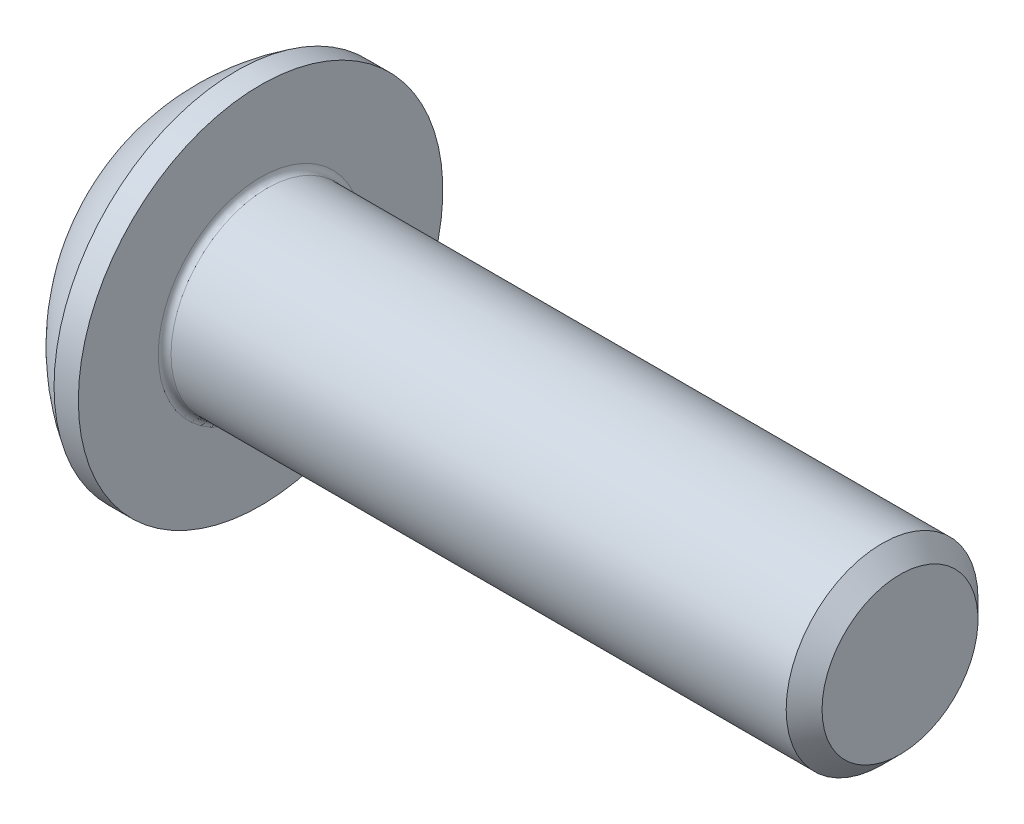
ISO-10303-21;
HEADER;
FILE_DESCRIPTION(('STEP AP214'),'2;1');
FILE_NAME('part.step','',(''),(''),'','','');
FILE_SCHEMA(('AUTOMOTIVE_DESIGN { 1 0 10303 214 1 1 1 1 }'));
ENDSEC;
DATA;
#1=APPLICATION_CONTEXT('core data for automotive mechanical design processes');
#2=APPLICATION_PROTOCOL_DEFINITION('international standard','automotive_design',2000,#1);
#3=PRODUCT_CONTEXT('',#1,'mechanical');
#4=PRODUCT('Part','Part','',(#3));
#5=PRODUCT_RELATED_PRODUCT_CATEGORY('part','',(#4));
#6=PRODUCT_DEFINITION_FORMATION('','',#4);
#7=PRODUCT_DEFINITION_CONTEXT('part definition',#1,'design');
#8=PRODUCT_DEFINITION('design','',#6,#7);
#9=PRODUCT_DEFINITION_SHAPE('','',#8);
#10=(LENGTH_UNIT() NAMED_UNIT(*) SI_UNIT(.MILLI.,.METRE.));
#11=(NAMED_UNIT(*) PLANE_ANGLE_UNIT() SI_UNIT($,.RADIAN.));
#12=(NAMED_UNIT(*) SI_UNIT($,.STERADIAN.) SOLID_ANGLE_UNIT());
#13=UNCERTAINTY_MEASURE_WITH_UNIT(LENGTH_MEASURE(1.E-05),#10,'distance_accuracy_value','');
#14=(GEOMETRIC_REPRESENTATION_CONTEXT(3) GLOBAL_UNCERTAINTY_ASSIGNED_CONTEXT((#13)) GLOBAL_UNIT_ASSIGNED_CONTEXT((#10,
#11,#12)) REPRESENTATION_CONTEXT('',''));
#15=CARTESIAN_POINT('',(0.,0.,0.));
#16=DIRECTION('',(0.,0.,1.));
#17=DIRECTION('',(1.,0.,0.));
#18=AXIS2_PLACEMENT_3D('',#15,#16,#17);
#19=CARTESIAN_POINT('',(0.,0.,0.));
#20=DIRECTION('',(-1.,0.,0.));
#21=DIRECTION('',(0.,0.,1.));
#22=AXIS2_PLACEMENT_3D('',#19,#20,#21);
#23=PLANE('',#22);
#24=CARTESIAN_POINT('',(0.,0.,0.));
#25=DIRECTION('',(-1.,0.,0.));
#26=DIRECTION('',(0.,0.,1.));
#27=AXIS2_PLACEMENT_3D('',#24,#25,#26);
#28=CIRCLE('',#27,1.425);
#29=CARTESIAN_POINT('',(0.,0.,1.425));
#30=VERTEX_POINT('',#29);
#31=EDGE_CURVE('E159',#30,#30,#28,.T.);
#32=ORIENTED_EDGE('',*,*,#31,.T.);
#33=EDGE_LOOP('',(#32));
#34=FACE_BOUND('',#33,.T.);
#35=DIRECTION('',(0.,-1.,0.));
#36=VECTOR('',#35,1.);
#37=CARTESIAN_POINT('',(0.,-0.577350269189625,1.));
#38=LINE('',#37,#36);
#39=CARTESIAN_POINT('',(0.,0.577350269189626,1.));
#40=VERTEX_POINT('',#39);
#41=CARTESIAN_POINT('',(0.,-0.577350269189625,1.));
#42=VERTEX_POINT('',#41);
#43=EDGE_CURVE('E49',#40,#42,#38,.T.);
#44=ORIENTED_EDGE('',*,*,#43,.T.);
#45=DIRECTION('',(0.,-0.5,-0.866025403784439));
#46=VECTOR('',#45,1.);
#47=CARTESIAN_POINT('',(0.,-1.15470053837925,0.));
#48=LINE('',#47,#46);
#49=CARTESIAN_POINT('',(0.,-1.15470053837925,0.));
#50=VERTEX_POINT('',#49);
#51=EDGE_CURVE('E252',#42,#50,#48,.T.);
#52=ORIENTED_EDGE('',*,*,#51,.T.);
#53=DIRECTION('',(0.,0.5,-0.866025403784439));
#54=VECTOR('',#53,1.);
#55=CARTESIAN_POINT('',(0.,-0.577350269189625,-1.));
#56=LINE('',#55,#54);
#57=CARTESIAN_POINT('',(0.,-0.577350269189625,-1.));
#58=VERTEX_POINT('',#57);
#59=EDGE_CURVE('E134',#50,#58,#56,.T.);
#60=ORIENTED_EDGE('',*,*,#59,.T.);
#61=DIRECTION('',(0.,1.,0.));
#62=VECTOR('',#61,1.);
#63=CARTESIAN_POINT('',(0.,0.577350269189626,-1.));
#64=LINE('',#63,#62);
#65=CARTESIAN_POINT('',(0.,0.577350269189626,-1.));
#66=VERTEX_POINT('',#65);
#67=EDGE_CURVE('E255',#58,#66,#64,.T.);
#68=ORIENTED_EDGE('',*,*,#67,.T.);
#69=DIRECTION('',(0.,0.5,0.866025403784438));
#70=VECTOR('',#69,1.);
#71=CARTESIAN_POINT('',(0.,1.15470053837925,0.));
#72=LINE('',#71,#70);
#73=CARTESIAN_POINT('',(0.,1.15470053837925,0.));
#74=VERTEX_POINT('',#73);
#75=EDGE_CURVE('E257',#66,#74,#72,.T.);
#76=ORIENTED_EDGE('',*,*,#75,.T.);
#77=DIRECTION('',(0.,-0.5,0.866025403784438));
#78=VECTOR('',#77,1.);
#79=CARTESIAN_POINT('',(0.,0.577350269189626,1.));
#80=LINE('',#79,#78);
#81=EDGE_CURVE('E259',#74,#40,#80,.T.);
#82=ORIENTED_EDGE('',*,*,#81,.T.);
#83=EDGE_LOOP('',(#44,#52,#60,#68,#76,#82));
#84=FACE_BOUND('',#83,.T.);
#85=ADVANCED_FACE('F34',(#34,#84),#23,.T.);
#86=CARTESIAN_POINT('',(3.03337598425197,0.,0.));
#87=DIRECTION('',(-1.,0.,0.));
#88=DIRECTION('',(0.,1.,0.));
#89=AXIS2_PLACEMENT_3D('',#86,#87,#88);
#90=SPHERICAL_SURFACE('',#89,3.35141684393878);
#91=CARTESIAN_POINT('',(1.27,0.,0.));
#92=DIRECTION('',(-1.,0.,0.));
#93=DIRECTION('',(0.,0.,1.));
#94=AXIS2_PLACEMENT_3D('',#91,#92,#93);
#95=CIRCLE('',#94,2.85);
#96=CARTESIAN_POINT('',(1.27,0.,2.85));
#97=VERTEX_POINT('',#96);
#98=EDGE_CURVE('E156',#97,#97,#95,.T.);
#99=ORIENTED_EDGE('',*,*,#98,.T.);
#100=EDGE_LOOP('',(#99));
#101=FACE_BOUND('',#100,.T.);
#102=ORIENTED_EDGE('',*,*,#31,.F.);
#103=EDGE_LOOP('',(#102));
#104=FACE_BOUND('',#103,.T.);
#105=ADVANCED_FACE('F180',(#101,#104),#90,.T.);
#106=CARTESIAN_POINT('',(0.,0.,0.));
#107=DIRECTION('',(-1.,0.,0.));
#108=DIRECTION('',(0.,0.,1.));
#109=AXIS2_PLACEMENT_3D('',#106,#107,#108);
#110=CYLINDRICAL_SURFACE('',#109,2.85);
#111=ORIENTED_EDGE('',*,*,#98,.F.);
#112=EDGE_LOOP('',(#111));
#113=FACE_BOUND('',#112,.T.);
#114=CARTESIAN_POINT('',(1.65,0.,0.));
#115=DIRECTION('',(-1.,0.,0.));
#116=DIRECTION('',(0.,0.,1.));
#117=AXIS2_PLACEMENT_3D('',#114,#115,#116);
#118=CIRCLE('',#117,2.85);
#119=CARTESIAN_POINT('',(1.65,0.,2.85));
#120=VERTEX_POINT('',#119);
#121=EDGE_CURVE('E153',#120,#120,#118,.T.);
#122=ORIENTED_EDGE('',*,*,#121,.T.);
#123=EDGE_LOOP('',(#122));
#124=FACE_BOUND('',#123,.T.);
#125=ADVANCED_FACE('F185',(#113,#124),#110,.T.);
#126=CARTESIAN_POINT('',(1.65,1.5,0.));
#127=DIRECTION('',(-1.,0.,0.));
#128=DIRECTION('',(0.,0.,1.));
#129=AXIS2_PLACEMENT_3D('',#126,#127,#128);
#130=PLANE('',#129);
#131=CARTESIAN_POINT('',(1.65,0.,0.));
#132=DIRECTION('',(-1.,0.,0.));
#133=DIRECTION('',(0.,0.,1.));
#134=AXIS2_PLACEMENT_3D('',#131,#132,#133);
#135=CIRCLE('',#134,1.6);
#136=CARTESIAN_POINT('',(1.65,0.,1.6));
#137=VERTEX_POINT('',#136);
#138=EDGE_CURVE('E42',#137,#137,#135,.T.);
#139=ORIENTED_EDGE('',*,*,#138,.T.);
#140=EDGE_LOOP('',(#139));
#141=FACE_BOUND('',#140,.T.);
#142=ORIENTED_EDGE('',*,*,#121,.F.);
#143=EDGE_LOOP('',(#142));
#144=FACE_BOUND('',#143,.T.);
#145=ADVANCED_FACE('F164',(#141,#144),#130,.F.);
#146=CARTESIAN_POINT('',(0.,0.,0.));
#147=DIRECTION('',(-1.,0.,0.));
#148=DIRECTION('',(0.,0.,1.));
#149=AXIS2_PLACEMENT_3D('',#146,#147,#148);
#150=CYLINDRICAL_SURFACE('',#149,1.5);
#151=CARTESIAN_POINT('',(1.75,0.,0.));
#152=DIRECTION('',(-1.,0.,0.));
#153=DIRECTION('',(0.,0.,1.));
#154=AXIS2_PLACEMENT_3D('',#151,#152,#153);
#155=CIRCLE('',#154,1.5);
#156=CARTESIAN_POINT('',(1.75,0.,1.5));
#157=VERTEX_POINT('',#156);
#158=EDGE_CURVE('E11',#157,#157,#155,.F.);
#159=ORIENTED_EDGE('',*,*,#158,.T.);
#160=EDGE_LOOP('',(#159));
#161=FACE_BOUND('',#160,.T.);
#162=CARTESIAN_POINT('',(11.3695,0.,0.));
#163=DIRECTION('',(-1.,0.,0.));
#164=DIRECTION('',(0.,0.,1.));
#165=AXIS2_PLACEMENT_3D('',#162,#163,#164);
#166=CIRCLE('',#165,1.5);
#167=CARTESIAN_POINT('',(11.3695,0.,1.5));
#168=VERTEX_POINT('',#167);
#169=EDGE_CURVE('E150',#168,#168,#166,.T.);
#170=ORIENTED_EDGE('',*,*,#169,.T.);
#171=EDGE_LOOP('',(#170));
#172=FACE_BOUND('',#171,.T.);
#173=ADVANCED_FACE('F194',(#161,#172),#150,.T.);
#174=CARTESIAN_POINT('',(11.65,0.,0.));
#175=DIRECTION('',(-1.,0.,0.));
#176=DIRECTION('',(0.,0.,1.));
#177=AXIS2_PLACEMENT_3D('',#174,#175,#176);
#178=CONICAL_SURFACE('',#177,1.2195,0.785398163397439);
#179=ORIENTED_EDGE('',*,*,#169,.F.);
#180=EDGE_LOOP('',(#179));
#181=FACE_BOUND('',#180,.T.);
#182=CARTESIAN_POINT('',(11.65,0.,0.));
#183=DIRECTION('',(-1.,0.,0.));
#184=DIRECTION('',(0.,0.,1.));
#185=AXIS2_PLACEMENT_3D('',#182,#183,#184);
#186=CIRCLE('',#185,1.2195);
#187=CARTESIAN_POINT('',(11.65,0.,1.2195));
#188=VERTEX_POINT('',#187);
#189=EDGE_CURVE('E146',#188,#188,#186,.T.);
#190=ORIENTED_EDGE('',*,*,#189,.T.);
#191=EDGE_LOOP('',(#190));
#192=FACE_BOUND('',#191,.T.);
#193=ADVANCED_FACE('F175',(#181,#192),#178,.T.);
#194=CARTESIAN_POINT('',(11.65,0.,0.));
#195=DIRECTION('',(-1.,0.,0.));
#196=DIRECTION('',(0.,0.,1.));
#197=AXIS2_PLACEMENT_3D('',#194,#195,#196);
#198=PLANE('',#197);
#199=ORIENTED_EDGE('',*,*,#189,.F.);
#200=EDGE_LOOP('',(#199));
#201=FACE_BOUND('',#200,.T.);
#202=ADVANCED_FACE('F168',(#201),#198,.F.);
#203=CARTESIAN_POINT('',(1.75,0.,0.));
#204=DIRECTION('',(-1.,0.,0.));
#205=DIRECTION('',(0.,0.,1.));
#206=AXIS2_PLACEMENT_3D('',#203,#204,#205);
#207=TOROIDAL_SURFACE('',#206,1.6,0.1);
#208=ORIENTED_EDGE('',*,*,#158,.F.);
#209=EDGE_LOOP('',(#208));
#210=FACE_BOUND('',#209,.T.);
#211=ORIENTED_EDGE('',*,*,#138,.F.);
#212=EDGE_LOOP('',(#211));
#213=FACE_BOUND('',#212,.T.);
#214=ADVANCED_FACE('F36',(#210,#213),#207,.F.);
#215=CARTESIAN_POINT('',(1.04,-1.15470053837925,0.));
#216=DIRECTION('',(0.,0.866025403784439,-0.5));
#217=DIRECTION('',(0.,0.5,0.866025403784439));
#218=AXIS2_PLACEMENT_3D('',#215,#216,#217);
#219=PLANE('',#218);
#220=DIRECTION('',(0.,-0.5,-0.866025403784439));
#221=VECTOR('',#220,1.);
#222=CARTESIAN_POINT('',(1.04,-1.15470053837925,0.));
#223=LINE('',#222,#221);
#224=CARTESIAN_POINT('',(1.04,-0.577350269189625,1.));
#225=VERTEX_POINT('',#224);
#226=CARTESIAN_POINT('',(1.04,-0.866025403784438,0.5));
#227=VERTEX_POINT('',#226);
#228=EDGE_CURVE('E117',#225,#227,#223,.T.);
#229=ORIENTED_EDGE('',*,*,#228,.T.);
#230=CARTESIAN_POINT('',(1.04,-1.15470053837925,0.));
#231=VERTEX_POINT('',#230);
#232=EDGE_CURVE('E110',#227,#231,#223,.T.);
#233=ORIENTED_EDGE('',*,*,#232,.T.);
#234=DIRECTION('',(-1.,0.,0.));
#235=VECTOR('',#234,1.);
#236=CARTESIAN_POINT('',(1.04,-1.15470053837925,0.));
#237=LINE('',#236,#235);
#238=EDGE_CURVE('E114',#231,#50,#237,.T.);
#239=ORIENTED_EDGE('',*,*,#238,.T.);
#240=ORIENTED_EDGE('',*,*,#51,.F.);
#241=DIRECTION('',(-1.,0.,0.));
#242=VECTOR('',#241,1.);
#243=CARTESIAN_POINT('',(1.04,-0.577350269189625,1.));
#244=LINE('',#243,#242);
#245=EDGE_CURVE('E242',#225,#42,#244,.T.);
#246=ORIENTED_EDGE('',*,*,#245,.F.);
#247=EDGE_LOOP('',(#229,#233,#239,#240,#246));
#248=FACE_BOUND('',#247,.T.);
#249=ADVANCED_FACE('F112',(#248),#219,.T.);
#250=CARTESIAN_POINT('',(1.04,-0.577350269189625,-1.));
#251=DIRECTION('',(0.,0.866025403784439,0.5));
#252=DIRECTION('',(0.,-0.5,0.866025403784439));
#253=AXIS2_PLACEMENT_3D('',#250,#251,#252);
#254=PLANE('',#253);
#255=DIRECTION('',(0.,0.5,-0.866025403784439));
#256=VECTOR('',#255,1.);
#257=CARTESIAN_POINT('',(1.04,-0.577350269189625,-1.));
#258=LINE('',#257,#256);
#259=CARTESIAN_POINT('',(1.04,-0.866025403784438,-0.5));
#260=VERTEX_POINT('',#259);
#261=EDGE_CURVE('E122',#231,#260,#258,.T.);
#262=ORIENTED_EDGE('',*,*,#261,.T.);
#263=CARTESIAN_POINT('',(1.04,-0.577350269189625,-1.));
#264=VERTEX_POINT('',#263);
#265=EDGE_CURVE('E129',#260,#264,#258,.T.);
#266=ORIENTED_EDGE('',*,*,#265,.T.);
#267=DIRECTION('',(-1.,0.,0.));
#268=VECTOR('',#267,1.);
#269=CARTESIAN_POINT('',(1.04,-0.577350269189625,-1.));
#270=LINE('',#269,#268);
#271=EDGE_CURVE('E136',#264,#58,#270,.T.);
#272=ORIENTED_EDGE('',*,*,#271,.T.);
#273=ORIENTED_EDGE('',*,*,#59,.F.);
#274=ORIENTED_EDGE('',*,*,#238,.F.);
#275=EDGE_LOOP('',(#262,#266,#272,#273,#274));
#276=FACE_BOUND('',#275,.T.);
#277=ADVANCED_FACE('F132',(#276),#254,.T.);
#278=CARTESIAN_POINT('',(1.04,0.577350269189626,-1.));
#279=DIRECTION('',(0.,0.,1.));
#280=DIRECTION('',(1.,0.,0.));
#281=AXIS2_PLACEMENT_3D('',#278,#279,#280);
#282=PLANE('',#281);
#283=DIRECTION('',(0.,1.,0.));
#284=VECTOR('',#283,1.);
#285=CARTESIAN_POINT('',(1.04,0.577350269189626,-1.));
#286=LINE('',#285,#284);
#287=CARTESIAN_POINT('',(1.04,0.,-1.));
#288=VERTEX_POINT('',#287);
#289=EDGE_CURVE('E278',#264,#288,#286,.T.);
#290=ORIENTED_EDGE('',*,*,#289,.T.);
#291=CARTESIAN_POINT('',(1.04,0.577350269189626,-1.));
#292=VERTEX_POINT('',#291);
#293=EDGE_CURVE('E128',#288,#292,#286,.T.);
#294=ORIENTED_EDGE('',*,*,#293,.T.);
#295=DIRECTION('',(-1.,0.,0.));
#296=VECTOR('',#295,1.);
#297=CARTESIAN_POINT('',(1.04,0.577350269189626,-1.));
#298=LINE('',#297,#296);
#299=EDGE_CURVE('E141',#292,#66,#298,.T.);
#300=ORIENTED_EDGE('',*,*,#299,.T.);
#301=ORIENTED_EDGE('',*,*,#67,.F.);
#302=ORIENTED_EDGE('',*,*,#271,.F.);
#303=EDGE_LOOP('',(#290,#294,#300,#301,#302));
#304=FACE_BOUND('',#303,.T.);
#305=ADVANCED_FACE('F208',(#304),#282,.T.);
#306=CARTESIAN_POINT('',(1.04,1.15470053837925,0.));
#307=DIRECTION('',(0.,-0.866025403784438,0.5));
#308=DIRECTION('',(0.,-0.5,-0.866025403784439));
#309=AXIS2_PLACEMENT_3D('',#306,#307,#308);
#310=PLANE('',#309);
#311=DIRECTION('',(0.,0.5,0.866025403784438));
#312=VECTOR('',#311,1.);
#313=CARTESIAN_POINT('',(1.04,1.15470053837925,0.));
#314=LINE('',#313,#312);
#315=CARTESIAN_POINT('',(1.04,0.866025403784439,-0.5));
#316=VERTEX_POINT('',#315);
#317=EDGE_CURVE('E284',#292,#316,#314,.T.);
#318=ORIENTED_EDGE('',*,*,#317,.T.);
#319=CARTESIAN_POINT('',(1.04,1.15470053837925,0.));
#320=VERTEX_POINT('',#319);
#321=EDGE_CURVE('E282',#316,#320,#314,.T.);
#322=ORIENTED_EDGE('',*,*,#321,.T.);
#323=DIRECTION('',(-1.,0.,0.));
#324=VECTOR('',#323,1.);
#325=CARTESIAN_POINT('',(1.04,1.15470053837925,0.));
#326=LINE('',#325,#324);
#327=EDGE_CURVE('E264',#320,#74,#326,.T.);
#328=ORIENTED_EDGE('',*,*,#327,.T.);
#329=ORIENTED_EDGE('',*,*,#75,.F.);
#330=ORIENTED_EDGE('',*,*,#299,.F.);
#331=EDGE_LOOP('',(#318,#322,#328,#329,#330));
#332=FACE_BOUND('',#331,.T.);
#333=ADVANCED_FACE('F211',(#332),#310,.T.);
#334=CARTESIAN_POINT('',(1.04,0.577350269189626,1.));
#335=DIRECTION('',(0.,-0.866025403784439,-0.5));
#336=DIRECTION('',(0.,0.5,-0.866025403784438));
#337=AXIS2_PLACEMENT_3D('',#334,#335,#336);
#338=PLANE('',#337);
#339=DIRECTION('',(0.,-0.5,0.866025403784438));
#340=VECTOR('',#339,1.);
#341=CARTESIAN_POINT('',(1.04,0.577350269189626,1.));
#342=LINE('',#341,#340);
#343=CARTESIAN_POINT('',(1.04,0.866025403784439,0.500000000000001));
#344=VERTEX_POINT('',#343);
#345=EDGE_CURVE('E248',#320,#344,#342,.T.);
#346=ORIENTED_EDGE('',*,*,#345,.T.);
#347=CARTESIAN_POINT('',(1.04,0.577350269189626,1.));
#348=VERTEX_POINT('',#347);
#349=EDGE_CURVE('E240',#344,#348,#342,.T.);
#350=ORIENTED_EDGE('',*,*,#349,.T.);
#351=DIRECTION('',(-1.,0.,0.));
#352=VECTOR('',#351,1.);
#353=CARTESIAN_POINT('',(1.04,0.577350269189626,1.));
#354=LINE('',#353,#352);
#355=EDGE_CURVE('E246',#348,#40,#354,.T.);
#356=ORIENTED_EDGE('',*,*,#355,.T.);
#357=ORIENTED_EDGE('',*,*,#81,.F.);
#358=ORIENTED_EDGE('',*,*,#327,.F.);
#359=EDGE_LOOP('',(#346,#350,#356,#357,#358));
#360=FACE_BOUND('',#359,.T.);
#361=ADVANCED_FACE('F215',(#360),#338,.T.);
#362=CARTESIAN_POINT('',(1.04,-0.577350269189625,1.));
#363=DIRECTION('',(0.,0.,-1.));
#364=DIRECTION('',(-1.,0.,0.));
#365=AXIS2_PLACEMENT_3D('',#362,#363,#364);
#366=PLANE('',#365);
#367=DIRECTION('',(0.,-1.,0.));
#368=VECTOR('',#367,1.);
#369=CARTESIAN_POINT('',(1.04,-0.577350269189625,1.));
#370=LINE('',#369,#368);
#371=CARTESIAN_POINT('',(1.04,0.,1.));
#372=VERTEX_POINT('',#371);
#373=EDGE_CURVE('E57',#348,#372,#370,.T.);
#374=ORIENTED_EDGE('',*,*,#373,.T.);
#375=EDGE_CURVE('E243',#372,#225,#370,.T.);
#376=ORIENTED_EDGE('',*,*,#375,.T.);
#377=ORIENTED_EDGE('',*,*,#245,.T.);
#378=ORIENTED_EDGE('',*,*,#43,.F.);
#379=ORIENTED_EDGE('',*,*,#355,.F.);
#380=EDGE_LOOP('',(#374,#376,#377,#378,#379));
#381=FACE_BOUND('',#380,.T.);
#382=ADVANCED_FACE('F219',(#381),#366,.T.);
#383=CARTESIAN_POINT('',(1.04,0.,2.));
#384=DIRECTION('',(-1.,0.,0.));
#385=DIRECTION('',(0.,0.,1.));
#386=AXIS2_PLACEMENT_3D('',#383,#384,#385);
#387=PLANE('',#386);
#388=ORIENTED_EDGE('',*,*,#373,.F.);
#389=ORIENTED_EDGE('',*,*,#349,.F.);
#390=CARTESIAN_POINT('',(1.04,0.,0.));
#391=DIRECTION('',(-1.,0.,0.));
#392=DIRECTION('',(0.,0.,1.));
#393=AXIS2_PLACEMENT_3D('',#390,#391,#392);
#394=CIRCLE('',#393,1.);
#395=EDGE_CURVE('E140',#372,#344,#394,.T.);
#396=ORIENTED_EDGE('',*,*,#395,.F.);
#397=EDGE_LOOP('',(#388,#389,#396));
#398=FACE_BOUND('',#397,.T.);
#399=ADVANCED_FACE('F223',(#398),#387,.T.);
#400=ORIENTED_EDGE('',*,*,#345,.F.);
#401=ORIENTED_EDGE('',*,*,#321,.F.);
#402=EDGE_CURVE('E147',#344,#316,#394,.T.);
#403=ORIENTED_EDGE('',*,*,#402,.F.);
#404=EDGE_LOOP('',(#400,#401,#403));
#405=FACE_BOUND('',#404,.T.);
#406=ADVANCED_FACE('F231',(#405),#387,.T.);
#407=ORIENTED_EDGE('',*,*,#317,.F.);
#408=ORIENTED_EDGE('',*,*,#293,.F.);
#409=EDGE_CURVE('E289',#316,#288,#394,.T.);
#410=ORIENTED_EDGE('',*,*,#409,.F.);
#411=EDGE_LOOP('',(#407,#408,#410));
#412=FACE_BOUND('',#411,.T.);
#413=ADVANCED_FACE('F236',(#412),#387,.T.);
#414=ORIENTED_EDGE('',*,*,#289,.F.);
#415=ORIENTED_EDGE('',*,*,#265,.F.);
#416=EDGE_CURVE('E281',#288,#260,#394,.T.);
#417=ORIENTED_EDGE('',*,*,#416,.F.);
#418=EDGE_LOOP('',(#414,#415,#417));
#419=FACE_BOUND('',#418,.T.);
#420=ADVANCED_FACE('F229',(#419),#387,.T.);
#421=ORIENTED_EDGE('',*,*,#261,.F.);
#422=ORIENTED_EDGE('',*,*,#232,.F.);
#423=EDGE_CURVE('E124',#260,#227,#394,.T.);
#424=ORIENTED_EDGE('',*,*,#423,.F.);
#425=EDGE_LOOP('',(#421,#422,#424));
#426=FACE_BOUND('',#425,.T.);
#427=ADVANCED_FACE('F123',(#426),#387,.T.);
#428=ORIENTED_EDGE('',*,*,#228,.F.);
#429=ORIENTED_EDGE('',*,*,#375,.F.);
#430=EDGE_CURVE('E135',#227,#372,#394,.T.);
#431=ORIENTED_EDGE('',*,*,#430,.F.);
#432=EDGE_LOOP('',(#428,#429,#431));
#433=FACE_BOUND('',#432,.T.);
#434=ADVANCED_FACE('F203',(#433),#387,.T.);
#435=CARTESIAN_POINT('',(1.61735026918963,0.,0.));
#436=DIRECTION('',(-1.,0.,0.));
#437=DIRECTION('',(0.,0.,1.));
#438=AXIS2_PLACEMENT_3D('',#435,#436,#437);
#439=CONICAL_SURFACE('',#438,0.,1.04719755119659);
#440=ORIENTED_EDGE('',*,*,#395,.T.);
#441=ORIENTED_EDGE('',*,*,#402,.T.);
#442=ORIENTED_EDGE('',*,*,#409,.T.);
#443=ORIENTED_EDGE('',*,*,#416,.T.);
#444=ORIENTED_EDGE('',*,*,#423,.T.);
#445=ORIENTED_EDGE('',*,*,#430,.T.);
#446=EDGE_LOOP('',(#440,#441,#442,#443,#444,#445));
#447=FACE_BOUND('',#446,.T.);
#448=CARTESIAN_POINT('',(1.61735026918963,0.,0.));
#449=VERTEX_POINT('',#448);
#450=VERTEX_LOOP('',#449);
#451=FACE_BOUND('',#450,.T.);
#452=ADVANCED_FACE('F201',(#447,#451),#439,.F.);
#453=CLOSED_SHELL('',(#85,#105,#125,#145,#173,#193,#202,#214,#249,#277,#305,#333,#361,#382,#399,
#406,#413,#420,#427,#434,#452));
#454=MANIFOLD_SOLID_BREP('B2',#453);
#455=ADVANCED_BREP_SHAPE_REPRESENTATION('',(#18,#454),#14);
#456=SHAPE_DEFINITION_REPRESENTATION(#9,#455);
ENDSEC;
END-ISO-10303-21;
